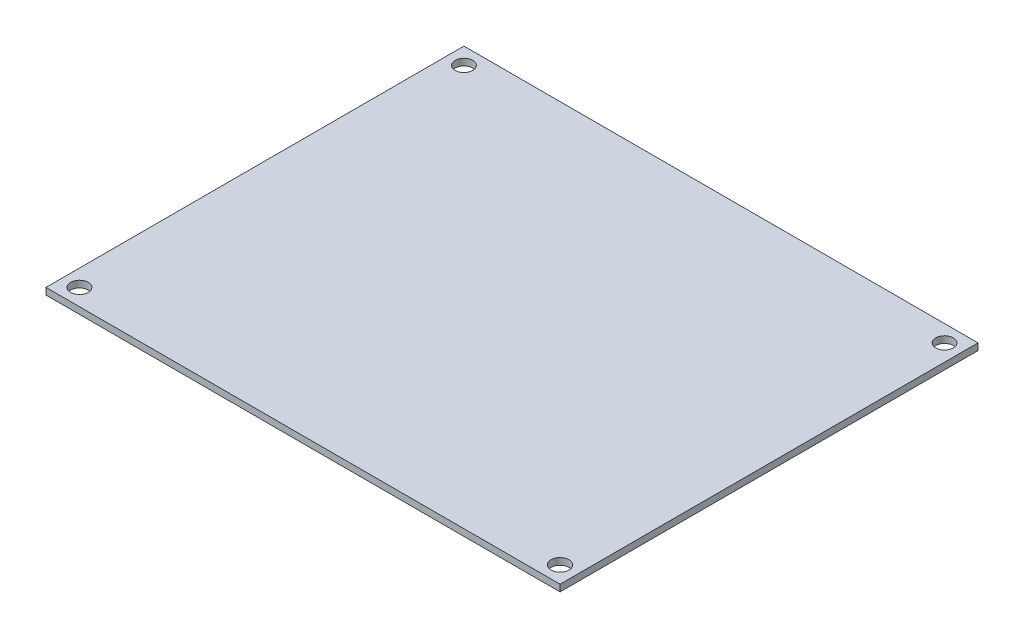
ISO-10303-21;
HEADER;
FILE_DESCRIPTION(('STEP AP214'),'2;1');
FILE_NAME('part.step','',(''),(''),'','','');
FILE_SCHEMA(('AUTOMOTIVE_DESIGN { 1 0 10303 214 1 1 1 1 }'));
ENDSEC;
DATA;
#1=APPLICATION_CONTEXT('core data for automotive mechanical design processes');
#2=APPLICATION_PROTOCOL_DEFINITION('international standard','automotive_design',2000,#1);
#3=PRODUCT_CONTEXT('',#1,'mechanical');
#4=PRODUCT('Part','Part','',(#3));
#5=PRODUCT_RELATED_PRODUCT_CATEGORY('part','',(#4));
#6=PRODUCT_DEFINITION_FORMATION('','',#4);
#7=PRODUCT_DEFINITION_CONTEXT('part definition',#1,'design');
#8=PRODUCT_DEFINITION('design','',#6,#7);
#9=PRODUCT_DEFINITION_SHAPE('','',#8);
#10=(LENGTH_UNIT() NAMED_UNIT(*) SI_UNIT(.MILLI.,.METRE.));
#11=(NAMED_UNIT(*) PLANE_ANGLE_UNIT() SI_UNIT($,.RADIAN.));
#12=(NAMED_UNIT(*) SI_UNIT($,.STERADIAN.) SOLID_ANGLE_UNIT());
#13=UNCERTAINTY_MEASURE_WITH_UNIT(LENGTH_MEASURE(1.E-05),#10,'distance_accuracy_value','');
#14=(GEOMETRIC_REPRESENTATION_CONTEXT(3) GLOBAL_UNCERTAINTY_ASSIGNED_CONTEXT((#13)) GLOBAL_UNIT_ASSIGNED_CONTEXT((#10,
#11,#12)) REPRESENTATION_CONTEXT('',''));
#15=CARTESIAN_POINT('',(0.,0.,0.));
#16=DIRECTION('',(0.,0.,1.));
#17=DIRECTION('',(1.,0.,0.));
#18=AXIS2_PLACEMENT_3D('',#15,#16,#17);
#19=CARTESIAN_POINT('',(0.,0.,0.));
#20=DIRECTION('',(0.,1.,0.));
#21=DIRECTION('',(0.,0.,1.));
#22=AXIS2_PLACEMENT_3D('',#19,#20,#21);
#23=PLANE('',#22);
#24=CARTESIAN_POINT('',(-57.5,0.,46.));
#25=DIRECTION('',(0.,1.,0.));
#26=DIRECTION('',(0.,0.,1.));
#27=AXIS2_PLACEMENT_3D('',#24,#25,#26);
#28=CIRCLE('',#27,2.1);
#29=CARTESIAN_POINT('',(-57.5,0.,48.1));
#30=VERTEX_POINT('',#29);
#31=EDGE_CURVE('E99',#30,#30,#28,.T.);
#32=ORIENTED_EDGE('',*,*,#31,.T.);
#33=EDGE_LOOP('',(#32));
#34=FACE_BOUND('',#33,.T.);
#35=CARTESIAN_POINT('',(57.5,0.,46.));
#36=DIRECTION('',(0.,1.,0.));
#37=DIRECTION('',(0.,0.,1.));
#38=AXIS2_PLACEMENT_3D('',#35,#36,#37);
#39=CIRCLE('',#38,2.15);
#40=CARTESIAN_POINT('',(57.5,0.,48.15));
#41=VERTEX_POINT('',#40);
#42=EDGE_CURVE('E103',#41,#41,#39,.T.);
#43=ORIENTED_EDGE('',*,*,#42,.T.);
#44=EDGE_LOOP('',(#43));
#45=FACE_BOUND('',#44,.T.);
#46=CARTESIAN_POINT('',(-57.5,0.,-46.));
#47=DIRECTION('',(0.,1.,0.));
#48=DIRECTION('',(0.,0.,1.));
#49=AXIS2_PLACEMENT_3D('',#46,#47,#48);
#50=CIRCLE('',#49,2.1);
#51=CARTESIAN_POINT('',(-57.5,0.,-43.9));
#52=VERTEX_POINT('',#51);
#53=EDGE_CURVE('E108',#52,#52,#50,.T.);
#54=ORIENTED_EDGE('',*,*,#53,.T.);
#55=EDGE_LOOP('',(#54));
#56=FACE_BOUND('',#55,.T.);
#57=CARTESIAN_POINT('',(57.5,0.,-46.));
#58=DIRECTION('',(0.,1.,0.));
#59=DIRECTION('',(0.,0.,1.));
#60=AXIS2_PLACEMENT_3D('',#57,#58,#59);
#61=CIRCLE('',#60,2.1);
#62=CARTESIAN_POINT('',(57.5,0.,-43.9));
#63=VERTEX_POINT('',#62);
#64=EDGE_CURVE('E113',#63,#63,#61,.T.);
#65=ORIENTED_EDGE('',*,*,#64,.T.);
#66=EDGE_LOOP('',(#65));
#67=FACE_BOUND('',#66,.T.);
#68=DIRECTION('',(0.,0.,1.));
#69=VECTOR('',#68,1.);
#70=CARTESIAN_POINT('',(-61.5,0.,-50.));
#71=LINE('',#70,#69);
#72=CARTESIAN_POINT('',(-61.5,0.,-50.));
#73=VERTEX_POINT('',#72);
#74=CARTESIAN_POINT('',(-61.5,0.,50.));
#75=VERTEX_POINT('',#74);
#76=EDGE_CURVE('E120',#73,#75,#71,.T.);
#77=ORIENTED_EDGE('',*,*,#76,.F.);
#78=DIRECTION('',(-1.,0.,0.));
#79=VECTOR('',#78,1.);
#80=CARTESIAN_POINT('',(61.5,0.,-50.));
#81=LINE('',#80,#79);
#82=CARTESIAN_POINT('',(61.5,0.,-50.));
#83=VERTEX_POINT('',#82);
#84=EDGE_CURVE('E55',#83,#73,#81,.T.);
#85=ORIENTED_EDGE('',*,*,#84,.F.);
#86=DIRECTION('',(0.,0.,-1.));
#87=VECTOR('',#86,1.);
#88=CARTESIAN_POINT('',(61.5,0.,50.));
#89=LINE('',#88,#87);
#90=CARTESIAN_POINT('',(61.5,0.,50.));
#91=VERTEX_POINT('',#90);
#92=EDGE_CURVE('E57',#91,#83,#89,.T.);
#93=ORIENTED_EDGE('',*,*,#92,.F.);
#94=DIRECTION('',(1.,0.,0.));
#95=VECTOR('',#94,1.);
#96=CARTESIAN_POINT('',(-61.5,0.,50.));
#97=LINE('',#96,#95);
#98=EDGE_CURVE('E59',#75,#91,#97,.T.);
#99=ORIENTED_EDGE('',*,*,#98,.F.);
#100=EDGE_LOOP('',(#77,#85,#93,#99));
#101=FACE_BOUND('',#100,.T.);
#102=ADVANCED_FACE('F17',(#34,#45,#56,#67,#101),#23,.F.);
#103=CARTESIAN_POINT('',(-61.5,0.,50.));
#104=DIRECTION('',(0.,0.,1.));
#105=DIRECTION('',(1.,0.,0.));
#106=AXIS2_PLACEMENT_3D('',#103,#104,#105);
#107=PLANE('',#106);
#108=DIRECTION('',(1.,0.,0.));
#109=VECTOR('',#108,1.);
#110=CARTESIAN_POINT('',(0.,1.6,50.));
#111=LINE('',#110,#109);
#112=CARTESIAN_POINT('',(-61.5,1.6,50.));
#113=VERTEX_POINT('',#112);
#114=CARTESIAN_POINT('',(61.5,1.6,50.));
#115=VERTEX_POINT('',#114);
#116=EDGE_CURVE('E102',#113,#115,#111,.T.);
#117=ORIENTED_EDGE('',*,*,#116,.F.);
#118=DIRECTION('',(0.,1.,0.));
#119=VECTOR('',#118,1.);
#120=CARTESIAN_POINT('',(-61.5,0.,50.));
#121=LINE('',#120,#119);
#122=EDGE_CURVE('E70',#75,#113,#121,.T.);
#123=ORIENTED_EDGE('',*,*,#122,.F.);
#124=ORIENTED_EDGE('',*,*,#98,.T.);
#125=DIRECTION('',(0.,1.,0.));
#126=VECTOR('',#125,1.);
#127=CARTESIAN_POINT('',(61.5,0.,50.));
#128=LINE('',#127,#126);
#129=EDGE_CURVE('E64',#115,#91,#128,.F.);
#130=ORIENTED_EDGE('',*,*,#129,.F.);
#131=EDGE_LOOP('',(#117,#123,#124,#130));
#132=FACE_BOUND('',#131,.T.);
#133=ADVANCED_FACE('F67',(#132),#107,.T.);
#134=CARTESIAN_POINT('',(61.5,0.,50.));
#135=DIRECTION('',(1.,0.,0.));
#136=DIRECTION('',(0.,0.,-1.));
#137=AXIS2_PLACEMENT_3D('',#134,#135,#136);
#138=PLANE('',#137);
#139=DIRECTION('',(0.,0.,1.));
#140=VECTOR('',#139,1.);
#141=CARTESIAN_POINT('',(61.5,1.6,0.));
#142=LINE('',#141,#140);
#143=CARTESIAN_POINT('',(61.5,1.6,-50.));
#144=VERTEX_POINT('',#143);
#145=EDGE_CURVE('E75',#115,#144,#142,.F.);
#146=ORIENTED_EDGE('',*,*,#145,.F.);
#147=ORIENTED_EDGE('',*,*,#129,.T.);
#148=ORIENTED_EDGE('',*,*,#92,.T.);
#149=DIRECTION('',(0.,1.,0.));
#150=VECTOR('',#149,1.);
#151=CARTESIAN_POINT('',(61.5,0.,-50.));
#152=LINE('',#151,#150);
#153=EDGE_CURVE('E78',#144,#83,#152,.F.);
#154=ORIENTED_EDGE('',*,*,#153,.F.);
#155=EDGE_LOOP('',(#146,#147,#148,#154));
#156=FACE_BOUND('',#155,.T.);
#157=ADVANCED_FACE('F73',(#156),#138,.T.);
#158=CARTESIAN_POINT('',(61.5,0.,-50.));
#159=DIRECTION('',(0.,0.,-1.));
#160=DIRECTION('',(-1.,0.,0.));
#161=AXIS2_PLACEMENT_3D('',#158,#159,#160);
#162=PLANE('',#161);
#163=DIRECTION('',(1.,0.,0.));
#164=VECTOR('',#163,1.);
#165=CARTESIAN_POINT('',(0.,1.6,-50.));
#166=LINE('',#165,#164);
#167=CARTESIAN_POINT('',(-61.5,1.6,-50.));
#168=VERTEX_POINT('',#167);
#169=EDGE_CURVE('E127',#144,#168,#166,.F.);
#170=ORIENTED_EDGE('',*,*,#169,.F.);
#171=ORIENTED_EDGE('',*,*,#153,.T.);
#172=ORIENTED_EDGE('',*,*,#84,.T.);
#173=DIRECTION('',(0.,1.,0.));
#174=VECTOR('',#173,1.);
#175=CARTESIAN_POINT('',(-61.5,0.,-50.));
#176=LINE('',#175,#174);
#177=EDGE_CURVE('E35',#168,#73,#176,.F.);
#178=ORIENTED_EDGE('',*,*,#177,.F.);
#179=EDGE_LOOP('',(#170,#171,#172,#178));
#180=FACE_BOUND('',#179,.T.);
#181=ADVANCED_FACE('F125',(#180),#162,.T.);
#182=CARTESIAN_POINT('',(-61.5,0.,-50.));
#183=DIRECTION('',(-1.,0.,0.));
#184=DIRECTION('',(0.,0.,1.));
#185=AXIS2_PLACEMENT_3D('',#182,#183,#184);
#186=PLANE('',#185);
#187=DIRECTION('',(0.,0.,1.));
#188=VECTOR('',#187,1.);
#189=CARTESIAN_POINT('',(-61.5,1.6,0.));
#190=LINE('',#189,#188);
#191=EDGE_CURVE('E96',#168,#113,#190,.T.);
#192=ORIENTED_EDGE('',*,*,#191,.F.);
#193=ORIENTED_EDGE('',*,*,#177,.T.);
#194=ORIENTED_EDGE('',*,*,#76,.T.);
#195=ORIENTED_EDGE('',*,*,#122,.T.);
#196=EDGE_LOOP('',(#192,#193,#194,#195));
#197=FACE_BOUND('',#196,.T.);
#198=ADVANCED_FACE('F133',(#197),#186,.T.);
#199=CARTESIAN_POINT('',(57.5,0.,-46.));
#200=DIRECTION('',(0.,1.,0.));
#201=DIRECTION('',(0.,0.,1.));
#202=AXIS2_PLACEMENT_3D('',#199,#200,#201);
#203=CYLINDRICAL_SURFACE('',#202,2.1);
#204=ORIENTED_EDGE('',*,*,#64,.F.);
#205=EDGE_LOOP('',(#204));
#206=FACE_BOUND('',#205,.T.);
#207=CARTESIAN_POINT('',(57.5,1.6,-46.));
#208=DIRECTION('',(0.,1.,0.));
#209=DIRECTION('',(0.,0.,1.));
#210=AXIS2_PLACEMENT_3D('',#207,#208,#209);
#211=CIRCLE('',#210,2.1);
#212=CARTESIAN_POINT('',(57.5,1.6,-43.9));
#213=VERTEX_POINT('',#212);
#214=EDGE_CURVE('E91',#213,#213,#211,.F.);
#215=ORIENTED_EDGE('',*,*,#214,.F.);
#216=EDGE_LOOP('',(#215));
#217=FACE_BOUND('',#216,.T.);
#218=ADVANCED_FACE('F135',(#206,#217),#203,.F.);
#219=CARTESIAN_POINT('',(-57.5,0.,-46.));
#220=DIRECTION('',(0.,1.,0.));
#221=DIRECTION('',(0.,0.,1.));
#222=AXIS2_PLACEMENT_3D('',#219,#220,#221);
#223=CYLINDRICAL_SURFACE('',#222,2.1);
#224=ORIENTED_EDGE('',*,*,#53,.F.);
#225=EDGE_LOOP('',(#224));
#226=FACE_BOUND('',#225,.T.);
#227=CARTESIAN_POINT('',(-57.5,1.6,-46.));
#228=DIRECTION('',(0.,1.,0.));
#229=DIRECTION('',(0.,0.,1.));
#230=AXIS2_PLACEMENT_3D('',#227,#228,#229);
#231=CIRCLE('',#230,2.1);
#232=CARTESIAN_POINT('',(-57.5,1.6,-43.9));
#233=VERTEX_POINT('',#232);
#234=EDGE_CURVE('E86',#233,#233,#231,.F.);
#235=ORIENTED_EDGE('',*,*,#234,.F.);
#236=EDGE_LOOP('',(#235));
#237=FACE_BOUND('',#236,.T.);
#238=ADVANCED_FACE('F142',(#226,#237),#223,.F.);
#239=CARTESIAN_POINT('',(57.5,0.,46.));
#240=DIRECTION('',(0.,1.,0.));
#241=DIRECTION('',(0.,0.,1.));
#242=AXIS2_PLACEMENT_3D('',#239,#240,#241);
#243=CYLINDRICAL_SURFACE('',#242,2.15);
#244=ORIENTED_EDGE('',*,*,#42,.F.);
#245=EDGE_LOOP('',(#244));
#246=FACE_BOUND('',#245,.T.);
#247=CARTESIAN_POINT('',(57.5,1.6,46.));
#248=DIRECTION('',(0.,1.,0.));
#249=DIRECTION('',(0.,0.,1.));
#250=AXIS2_PLACEMENT_3D('',#247,#248,#249);
#251=CIRCLE('',#250,2.15);
#252=CARTESIAN_POINT('',(57.5,1.6,48.15));
#253=VERTEX_POINT('',#252);
#254=EDGE_CURVE('E26',#253,#253,#251,.F.);
#255=ORIENTED_EDGE('',*,*,#254,.F.);
#256=EDGE_LOOP('',(#255));
#257=FACE_BOUND('',#256,.T.);
#258=ADVANCED_FACE('F153',(#246,#257),#243,.F.);
#259=CARTESIAN_POINT('',(-57.5,0.,46.));
#260=DIRECTION('',(0.,1.,0.));
#261=DIRECTION('',(0.,0.,1.));
#262=AXIS2_PLACEMENT_3D('',#259,#260,#261);
#263=CYLINDRICAL_SURFACE('',#262,2.1);
#264=ORIENTED_EDGE('',*,*,#31,.F.);
#265=EDGE_LOOP('',(#264));
#266=FACE_BOUND('',#265,.T.);
#267=CARTESIAN_POINT('',(-57.5,1.6,46.));
#268=DIRECTION('',(0.,1.,0.));
#269=DIRECTION('',(0.,0.,1.));
#270=AXIS2_PLACEMENT_3D('',#267,#268,#269);
#271=CIRCLE('',#270,2.1);
#272=CARTESIAN_POINT('',(-57.5,1.6,48.1));
#273=VERTEX_POINT('',#272);
#274=EDGE_CURVE('E11',#273,#273,#271,.F.);
#275=ORIENTED_EDGE('',*,*,#274,.F.);
#276=EDGE_LOOP('',(#275));
#277=FACE_BOUND('',#276,.T.);
#278=ADVANCED_FACE('F147',(#266,#277),#263,.F.);
#279=CARTESIAN_POINT('',(0.,1.6,0.));
#280=DIRECTION('',(0.,1.,0.));
#281=DIRECTION('',(0.,0.,1.));
#282=AXIS2_PLACEMENT_3D('',#279,#280,#281);
#283=PLANE('',#282);
#284=ORIENTED_EDGE('',*,*,#274,.T.);
#285=EDGE_LOOP('',(#284));
#286=FACE_BOUND('',#285,.T.);
#287=ORIENTED_EDGE('',*,*,#254,.T.);
#288=EDGE_LOOP('',(#287));
#289=FACE_BOUND('',#288,.T.);
#290=ORIENTED_EDGE('',*,*,#234,.T.);
#291=EDGE_LOOP('',(#290));
#292=FACE_BOUND('',#291,.T.);
#293=ORIENTED_EDGE('',*,*,#214,.T.);
#294=EDGE_LOOP('',(#293));
#295=FACE_BOUND('',#294,.T.);
#296=ORIENTED_EDGE('',*,*,#169,.T.);
#297=ORIENTED_EDGE('',*,*,#191,.T.);
#298=ORIENTED_EDGE('',*,*,#116,.T.);
#299=ORIENTED_EDGE('',*,*,#145,.T.);
#300=EDGE_LOOP('',(#296,#297,#298,#299));
#301=FACE_BOUND('',#300,.T.);
#302=ADVANCED_FACE('F131',(#286,#289,#292,#295,#301),#283,.T.);
#303=CLOSED_SHELL('',(#102,#133,#157,#181,#198,#218,#238,#258,#278,#302));
#304=MANIFOLD_SOLID_BREP('B1',#303);
#305=ADVANCED_BREP_SHAPE_REPRESENTATION('',(#18,#304),#14);
#306=SHAPE_DEFINITION_REPRESENTATION(#9,#305);
ENDSEC;
END-ISO-10303-21;
